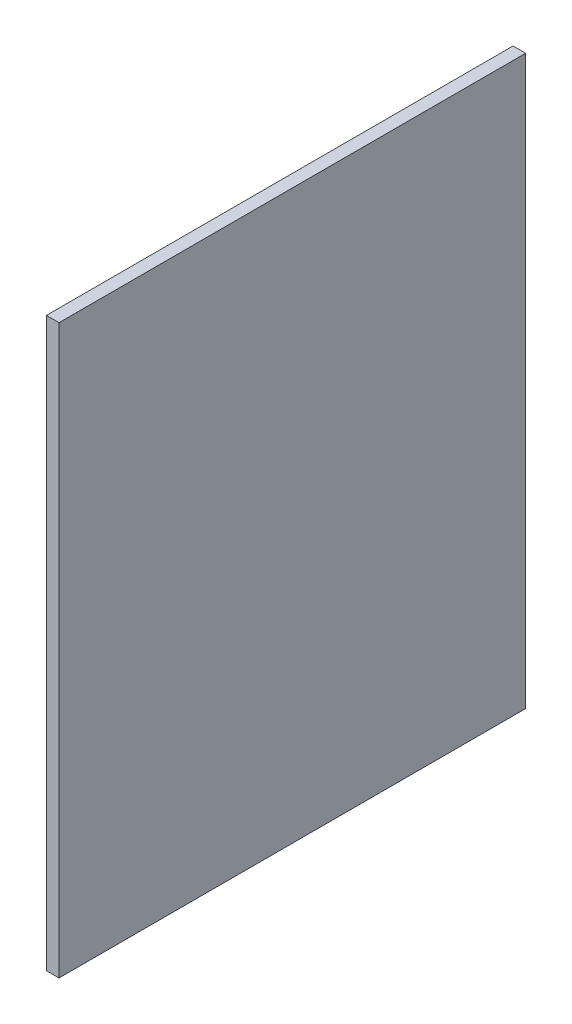
ISO-10303-21;
HEADER;
FILE_DESCRIPTION(('STEP AP214'),'2;1');
FILE_NAME('part.step','',(''),(''),'','','');
FILE_SCHEMA(('AUTOMOTIVE_DESIGN { 1 0 10303 214 1 1 1 1 }'));
ENDSEC;
DATA;
#1=APPLICATION_CONTEXT('core data for automotive mechanical design processes');
#2=APPLICATION_PROTOCOL_DEFINITION('international standard','automotive_design',2000,#1);
#3=PRODUCT_CONTEXT('',#1,'mechanical');
#4=PRODUCT('Part','Part','',(#3));
#5=PRODUCT_RELATED_PRODUCT_CATEGORY('part','',(#4));
#6=PRODUCT_DEFINITION_FORMATION('','',#4);
#7=PRODUCT_DEFINITION_CONTEXT('part definition',#1,'design');
#8=PRODUCT_DEFINITION('design','',#6,#7);
#9=PRODUCT_DEFINITION_SHAPE('','',#8);
#10=(LENGTH_UNIT() NAMED_UNIT(*) SI_UNIT(.MILLI.,.METRE.));
#11=(NAMED_UNIT(*) PLANE_ANGLE_UNIT() SI_UNIT($,.RADIAN.));
#12=(NAMED_UNIT(*) SI_UNIT($,.STERADIAN.) SOLID_ANGLE_UNIT());
#13=UNCERTAINTY_MEASURE_WITH_UNIT(LENGTH_MEASURE(1.E-05),#10,'distance_accuracy_value','');
#14=(GEOMETRIC_REPRESENTATION_CONTEXT(3) GLOBAL_UNCERTAINTY_ASSIGNED_CONTEXT((#13)) GLOBAL_UNIT_ASSIGNED_CONTEXT((#10,
#11,#12)) REPRESENTATION_CONTEXT('',''));
#15=CARTESIAN_POINT('',(0.,0.,0.));
#16=DIRECTION('',(0.,0.,1.));
#17=DIRECTION('',(1.,0.,0.));
#18=AXIS2_PLACEMENT_3D('',#15,#16,#17);
#19=CARTESIAN_POINT('',(-40.,259.,-37.0000000000001));
#20=DIRECTION('',(0.,0.,1.));
#21=DIRECTION('',(0.,-1.,0.));
#22=AXIS2_PLACEMENT_3D('',#19,#20,#21);
#23=PLANE('',#22);
#24=DIRECTION('',(0.,-1.,0.));
#25=VECTOR('',#24,1.);
#26=CARTESIAN_POINT('',(-38.,259.,-37.0000000000001));
#27=LINE('',#26,#25);
#28=CARTESIAN_POINT('',(-38.,259.,-37.0000000000001));
#29=VERTEX_POINT('',#28);
#30=CARTESIAN_POINT('',(-38.,169.,-37.));
#31=VERTEX_POINT('',#30);
#32=EDGE_CURVE('E99',#29,#31,#27,.T.);
#33=ORIENTED_EDGE('',*,*,#32,.T.);
#34=DIRECTION('',(1.,0.,0.));
#35=VECTOR('',#34,1.);
#36=CARTESIAN_POINT('',(-40.,169.,-37.));
#37=LINE('',#36,#35);
#38=CARTESIAN_POINT('',(-40.,169.,-37.));
#39=VERTEX_POINT('',#38);
#40=EDGE_CURVE('E11',#39,#31,#37,.T.);
#41=ORIENTED_EDGE('',*,*,#40,.F.);
#42=DIRECTION('',(0.,-1.,0.));
#43=VECTOR('',#42,1.);
#44=CARTESIAN_POINT('',(-40.,259.,-37.0000000000001));
#45=LINE('',#44,#43);
#46=CARTESIAN_POINT('',(-40.,259.,-37.0000000000001));
#47=VERTEX_POINT('',#46);
#48=EDGE_CURVE('E87',#47,#39,#45,.T.);
#49=ORIENTED_EDGE('',*,*,#48,.F.);
#50=DIRECTION('',(1.,0.,0.));
#51=VECTOR('',#50,1.);
#52=CARTESIAN_POINT('',(-40.,259.,-37.0000000000001));
#53=LINE('',#52,#51);
#54=EDGE_CURVE('E95',#47,#29,#53,.T.);
#55=ORIENTED_EDGE('',*,*,#54,.T.);
#56=EDGE_LOOP('',(#33,#41,#49,#55));
#57=FACE_BOUND('',#56,.T.);
#58=ADVANCED_FACE('F36',(#57),#23,.F.);
#59=CARTESIAN_POINT('',(-40.,169.,-37.));
#60=DIRECTION('',(0.,1.,0.));
#61=DIRECTION('',(0.,0.,1.));
#62=AXIS2_PLACEMENT_3D('',#59,#60,#61);
#63=PLANE('',#62);
#64=DIRECTION('',(0.,0.,1.));
#65=VECTOR('',#64,1.);
#66=CARTESIAN_POINT('',(-38.,169.,-37.));
#67=LINE('',#66,#65);
#68=CARTESIAN_POINT('',(-38.,169.,37.));
#69=VERTEX_POINT('',#68);
#70=EDGE_CURVE('E91',#31,#69,#67,.T.);
#71=ORIENTED_EDGE('',*,*,#70,.T.);
#72=DIRECTION('',(1.,0.,0.));
#73=VECTOR('',#72,1.);
#74=CARTESIAN_POINT('',(-40.,169.,37.));
#75=LINE('',#74,#73);
#76=CARTESIAN_POINT('',(-40.,169.,37.));
#77=VERTEX_POINT('',#76);
#78=EDGE_CURVE('E44',#77,#69,#75,.T.);
#79=ORIENTED_EDGE('',*,*,#78,.F.);
#80=DIRECTION('',(0.,0.,1.));
#81=VECTOR('',#80,1.);
#82=CARTESIAN_POINT('',(-40.,169.,-37.));
#83=LINE('',#82,#81);
#84=EDGE_CURVE('E82',#39,#77,#83,.T.);
#85=ORIENTED_EDGE('',*,*,#84,.F.);
#86=ORIENTED_EDGE('',*,*,#40,.T.);
#87=EDGE_LOOP('',(#71,#79,#85,#86));
#88=FACE_BOUND('',#87,.T.);
#89=ADVANCED_FACE('F90',(#88),#63,.F.);
#90=CARTESIAN_POINT('',(-40.,259.,36.9999999999999));
#91=DIRECTION('',(0.,0.,-1.));
#92=DIRECTION('',(0.,1.,0.));
#93=AXIS2_PLACEMENT_3D('',#90,#91,#92);
#94=PLANE('',#93);
#95=DIRECTION('',(0.,1.,0.));
#96=VECTOR('',#95,1.);
#97=CARTESIAN_POINT('',(-38.,259.,36.9999999999999));
#98=LINE('',#97,#96);
#99=CARTESIAN_POINT('',(-38.,259.,36.9999999999999));
#100=VERTEX_POINT('',#99);
#101=EDGE_CURVE('E69',#69,#100,#98,.T.);
#102=ORIENTED_EDGE('',*,*,#101,.T.);
#103=DIRECTION('',(1.,0.,0.));
#104=VECTOR('',#103,1.);
#105=CARTESIAN_POINT('',(-40.,259.,36.9999999999999));
#106=LINE('',#105,#104);
#107=CARTESIAN_POINT('',(-40.,259.,36.9999999999999));
#108=VERTEX_POINT('',#107);
#109=EDGE_CURVE('E92',#108,#100,#106,.T.);
#110=ORIENTED_EDGE('',*,*,#109,.F.);
#111=DIRECTION('',(0.,1.,0.));
#112=VECTOR('',#111,1.);
#113=CARTESIAN_POINT('',(-40.,259.,36.9999999999999));
#114=LINE('',#113,#112);
#115=EDGE_CURVE('E85',#77,#108,#114,.T.);
#116=ORIENTED_EDGE('',*,*,#115,.F.);
#117=ORIENTED_EDGE('',*,*,#78,.T.);
#118=EDGE_LOOP('',(#102,#110,#116,#117));
#119=FACE_BOUND('',#118,.T.);
#120=ADVANCED_FACE('F93',(#119),#94,.F.);
#121=CARTESIAN_POINT('',(-40.,259.,-37.0000000000001));
#122=DIRECTION('',(0.,-1.,0.));
#123=DIRECTION('',(0.,0.,-1.));
#124=AXIS2_PLACEMENT_3D('',#121,#122,#123);
#125=PLANE('',#124);
#126=DIRECTION('',(0.,0.,-1.));
#127=VECTOR('',#126,1.);
#128=CARTESIAN_POINT('',(-38.,259.,-37.0000000000001));
#129=LINE('',#128,#127);
#130=EDGE_CURVE('E75',#100,#29,#129,.T.);
#131=ORIENTED_EDGE('',*,*,#130,.T.);
#132=ORIENTED_EDGE('',*,*,#54,.F.);
#133=DIRECTION('',(0.,0.,-1.));
#134=VECTOR('',#133,1.);
#135=CARTESIAN_POINT('',(-40.,259.,-37.0000000000001));
#136=LINE('',#135,#134);
#137=EDGE_CURVE('E52',#108,#47,#136,.T.);
#138=ORIENTED_EDGE('',*,*,#137,.F.);
#139=ORIENTED_EDGE('',*,*,#109,.T.);
#140=EDGE_LOOP('',(#131,#132,#138,#139));
#141=FACE_BOUND('',#140,.T.);
#142=ADVANCED_FACE('F106',(#141),#125,.F.);
#143=CARTESIAN_POINT('',(-40.,0.,0.));
#144=DIRECTION('',(-1.,0.,0.));
#145=DIRECTION('',(0.,0.,1.));
#146=AXIS2_PLACEMENT_3D('',#143,#144,#145);
#147=PLANE('',#146);
#148=ORIENTED_EDGE('',*,*,#48,.T.);
#149=ORIENTED_EDGE('',*,*,#84,.T.);
#150=ORIENTED_EDGE('',*,*,#115,.T.);
#151=ORIENTED_EDGE('',*,*,#137,.T.);
#152=EDGE_LOOP('',(#148,#149,#150,#151));
#153=FACE_BOUND('',#152,.T.);
#154=ADVANCED_FACE('F83',(#153),#147,.T.);
#155=CARTESIAN_POINT('',(-38.,0.,0.));
#156=DIRECTION('',(-1.,0.,0.));
#157=DIRECTION('',(0.,0.,1.));
#158=AXIS2_PLACEMENT_3D('',#155,#156,#157);
#159=PLANE('',#158);
#160=ORIENTED_EDGE('',*,*,#32,.F.);
#161=ORIENTED_EDGE('',*,*,#130,.F.);
#162=ORIENTED_EDGE('',*,*,#101,.F.);
#163=ORIENTED_EDGE('',*,*,#70,.F.);
#164=EDGE_LOOP('',(#160,#161,#162,#163));
#165=FACE_BOUND('',#164,.T.);
#166=ADVANCED_FACE('F109',(#165),#159,.F.);
#167=CLOSED_SHELL('',(#58,#89,#120,#142,#154,#166));
#168=MANIFOLD_SOLID_BREP('B2',#167);
#169=ADVANCED_BREP_SHAPE_REPRESENTATION('',(#18,#168),#14);
#170=SHAPE_DEFINITION_REPRESENTATION(#9,#169);
ENDSEC;
END-ISO-10303-21;
